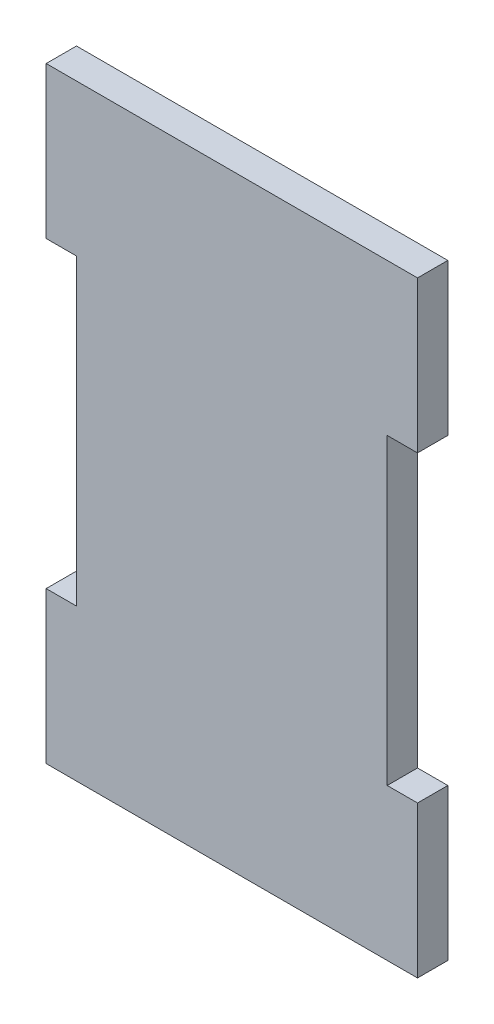
ISO-10303-21;
HEADER;
FILE_DESCRIPTION(('STEP AP214'),'2;1');
FILE_NAME('part.step','',(''),(''),'','','');
FILE_SCHEMA(('AUTOMOTIVE_DESIGN { 1 0 10303 214 1 1 1 1 }'));
ENDSEC;
DATA;
#1=APPLICATION_CONTEXT('core data for automotive mechanical design processes');
#2=APPLICATION_PROTOCOL_DEFINITION('international standard','automotive_design',2000,#1);
#3=PRODUCT_CONTEXT('',#1,'mechanical');
#4=PRODUCT('Part','Part','',(#3));
#5=PRODUCT_RELATED_PRODUCT_CATEGORY('part','',(#4));
#6=PRODUCT_DEFINITION_FORMATION('','',#4);
#7=PRODUCT_DEFINITION_CONTEXT('part definition',#1,'design');
#8=PRODUCT_DEFINITION('design','',#6,#7);
#9=PRODUCT_DEFINITION_SHAPE('','',#8);
#10=(LENGTH_UNIT() NAMED_UNIT(*) SI_UNIT(.MILLI.,.METRE.));
#11=(NAMED_UNIT(*) PLANE_ANGLE_UNIT() SI_UNIT($,.RADIAN.));
#12=(NAMED_UNIT(*) SI_UNIT($,.STERADIAN.) SOLID_ANGLE_UNIT());
#13=UNCERTAINTY_MEASURE_WITH_UNIT(LENGTH_MEASURE(1.E-05),#10,'distance_accuracy_value','');
#14=(GEOMETRIC_REPRESENTATION_CONTEXT(3) GLOBAL_UNCERTAINTY_ASSIGNED_CONTEXT((#13)) GLOBAL_UNIT_ASSIGNED_CONTEXT((#10,
#11,#12)) REPRESENTATION_CONTEXT('',''));
#15=CARTESIAN_POINT('',(0.,0.,0.));
#16=DIRECTION('',(0.,0.,1.));
#17=DIRECTION('',(1.,0.,0.));
#18=AXIS2_PLACEMENT_3D('',#15,#16,#17);
#19=CARTESIAN_POINT('',(-26.035,0.,5.08));
#20=DIRECTION('',(-1.,0.,0.));
#21=DIRECTION('',(0.,-1.,0.));
#22=AXIS2_PLACEMENT_3D('',#19,#20,#21);
#23=PLANE('',#22);
#24=DIRECTION('',(0.,1.,0.));
#25=VECTOR('',#24,1.);
#26=CARTESIAN_POINT('',(-26.035,0.,0.));
#27=LINE('',#26,#25);
#28=CARTESIAN_POINT('',(-26.035,-25.4,0.));
#29=VERTEX_POINT('',#28);
#30=CARTESIAN_POINT('',(-26.035,25.4,0.));
#31=VERTEX_POINT('',#30);
#32=EDGE_CURVE('E152',#29,#31,#27,.T.);
#33=ORIENTED_EDGE('',*,*,#32,.F.);
#34=DIRECTION('',(0.,0.,-1.));
#35=VECTOR('',#34,1.);
#36=CARTESIAN_POINT('',(-26.035,-25.4,5.08));
#37=LINE('',#36,#35);
#38=CARTESIAN_POINT('',(-26.035,-25.4,5.08));
#39=VERTEX_POINT('',#38);
#40=EDGE_CURVE('E11',#39,#29,#37,.T.);
#41=ORIENTED_EDGE('',*,*,#40,.F.);
#42=DIRECTION('',(0.,1.,0.));
#43=VECTOR('',#42,1.);
#44=CARTESIAN_POINT('',(-26.035,0.,5.08));
#45=LINE('',#44,#43);
#46=CARTESIAN_POINT('',(-26.035,25.4,5.08));
#47=VERTEX_POINT('',#46);
#48=EDGE_CURVE('E183',#39,#47,#45,.T.);
#49=ORIENTED_EDGE('',*,*,#48,.T.);
#50=DIRECTION('',(0.,0.,-1.));
#51=VECTOR('',#50,1.);
#52=CARTESIAN_POINT('',(-26.035,25.4,5.08));
#53=LINE('',#52,#51);
#54=EDGE_CURVE('E51',#47,#31,#53,.T.);
#55=ORIENTED_EDGE('',*,*,#54,.T.);
#56=EDGE_LOOP('',(#33,#41,#49,#55));
#57=FACE_BOUND('',#56,.T.);
#58=ADVANCED_FACE('F35',(#57),#23,.T.);
#59=CARTESIAN_POINT('',(0.,-25.4,5.08));
#60=DIRECTION('',(0.,-1.,0.));
#61=DIRECTION('',(0.,0.,-1.));
#62=AXIS2_PLACEMENT_3D('',#59,#60,#61);
#63=PLANE('',#62);
#64=DIRECTION('',(-1.,0.,0.));
#65=VECTOR('',#64,1.);
#66=CARTESIAN_POINT('',(0.,-25.4,0.));
#67=LINE('',#66,#65);
#68=CARTESIAN_POINT('',(-31.115,-25.4,0.));
#69=VERTEX_POINT('',#68);
#70=EDGE_CURVE('E154',#29,#69,#67,.T.);
#71=ORIENTED_EDGE('',*,*,#70,.T.);
#72=DIRECTION('',(0.,0.,-1.));
#73=VECTOR('',#72,1.);
#74=CARTESIAN_POINT('',(-31.115,-25.4,5.08));
#75=LINE('',#74,#73);
#76=CARTESIAN_POINT('',(-31.115,-25.4,5.08));
#77=VERTEX_POINT('',#76);
#78=EDGE_CURVE('E43',#77,#69,#75,.T.);
#79=ORIENTED_EDGE('',*,*,#78,.F.);
#80=DIRECTION('',(-1.,0.,0.));
#81=VECTOR('',#80,1.);
#82=CARTESIAN_POINT('',(0.,-25.4,5.08));
#83=LINE('',#82,#81);
#84=EDGE_CURVE('E219',#39,#77,#83,.T.);
#85=ORIENTED_EDGE('',*,*,#84,.F.);
#86=ORIENTED_EDGE('',*,*,#40,.T.);
#87=EDGE_LOOP('',(#71,#79,#85,#86));
#88=FACE_BOUND('',#87,.T.);
#89=ADVANCED_FACE('F208',(#88),#63,.F.);
#90=CARTESIAN_POINT('',(-31.115,0.,5.08));
#91=DIRECTION('',(-1.,0.,0.));
#92=DIRECTION('',(0.,0.,1.));
#93=AXIS2_PLACEMENT_3D('',#90,#91,#92);
#94=PLANE('',#93);
#95=DIRECTION('',(0.,1.,0.));
#96=VECTOR('',#95,1.);
#97=CARTESIAN_POINT('',(-31.115,0.,0.));
#98=LINE('',#97,#96);
#99=CARTESIAN_POINT('',(-31.115,-50.8,0.));
#100=VERTEX_POINT('',#99);
#101=EDGE_CURVE('E157',#100,#69,#98,.T.);
#102=ORIENTED_EDGE('',*,*,#101,.F.);
#103=DIRECTION('',(0.,0.,-1.));
#104=VECTOR('',#103,1.);
#105=CARTESIAN_POINT('',(-31.115,-50.8,5.08));
#106=LINE('',#105,#104);
#107=CARTESIAN_POINT('',(-31.115,-50.8,5.08));
#108=VERTEX_POINT('',#107);
#109=EDGE_CURVE('E198',#108,#100,#106,.T.);
#110=ORIENTED_EDGE('',*,*,#109,.F.);
#111=DIRECTION('',(0.,1.,0.));
#112=VECTOR('',#111,1.);
#113=CARTESIAN_POINT('',(-31.115,0.,5.08));
#114=LINE('',#113,#112);
#115=EDGE_CURVE('E205',#108,#77,#114,.T.);
#116=ORIENTED_EDGE('',*,*,#115,.T.);
#117=ORIENTED_EDGE('',*,*,#78,.T.);
#118=EDGE_LOOP('',(#102,#110,#116,#117));
#119=FACE_BOUND('',#118,.T.);
#120=ADVANCED_FACE('F203',(#119),#94,.T.);
#121=CARTESIAN_POINT('',(0.,-50.8,5.08));
#122=DIRECTION('',(0.,-1.,0.));
#123=DIRECTION('',(1.,0.,0.));
#124=AXIS2_PLACEMENT_3D('',#121,#122,#123);
#125=PLANE('',#124);
#126=DIRECTION('',(-1.,0.,0.));
#127=VECTOR('',#126,1.);
#128=CARTESIAN_POINT('',(0.,-50.8,0.));
#129=LINE('',#128,#127);
#130=CARTESIAN_POINT('',(31.115,-50.8,0.));
#131=VERTEX_POINT('',#130);
#132=EDGE_CURVE('E160',#131,#100,#129,.T.);
#133=ORIENTED_EDGE('',*,*,#132,.F.);
#134=DIRECTION('',(0.,0.,-1.));
#135=VECTOR('',#134,1.);
#136=CARTESIAN_POINT('',(31.115,-50.8,5.08));
#137=LINE('',#136,#135);
#138=CARTESIAN_POINT('',(31.115,-50.8,5.08));
#139=VERTEX_POINT('',#138);
#140=EDGE_CURVE('E196',#139,#131,#137,.T.);
#141=ORIENTED_EDGE('',*,*,#140,.F.);
#142=DIRECTION('',(-1.,0.,0.));
#143=VECTOR('',#142,1.);
#144=CARTESIAN_POINT('',(0.,-50.8,5.08));
#145=LINE('',#144,#143);
#146=EDGE_CURVE('E218',#139,#108,#145,.T.);
#147=ORIENTED_EDGE('',*,*,#146,.T.);
#148=ORIENTED_EDGE('',*,*,#109,.T.);
#149=EDGE_LOOP('',(#133,#141,#147,#148));
#150=FACE_BOUND('',#149,.T.);
#151=ADVANCED_FACE('F214',(#150),#125,.T.);
#152=CARTESIAN_POINT('',(31.115,0.,5.08));
#153=DIRECTION('',(-1.,0.,0.));
#154=DIRECTION('',(0.,0.,1.));
#155=AXIS2_PLACEMENT_3D('',#152,#153,#154);
#156=PLANE('',#155);
#157=DIRECTION('',(0.,1.,0.));
#158=VECTOR('',#157,1.);
#159=CARTESIAN_POINT('',(31.115,0.,0.));
#160=LINE('',#159,#158);
#161=CARTESIAN_POINT('',(31.115,-25.4,0.));
#162=VERTEX_POINT('',#161);
#163=EDGE_CURVE('E163',#131,#162,#160,.T.);
#164=ORIENTED_EDGE('',*,*,#163,.T.);
#165=DIRECTION('',(0.,0.,-1.));
#166=VECTOR('',#165,1.);
#167=CARTESIAN_POINT('',(31.115,-25.4,5.08));
#168=LINE('',#167,#166);
#169=CARTESIAN_POINT('',(31.115,-25.4,5.08));
#170=VERTEX_POINT('',#169);
#171=EDGE_CURVE('E194',#170,#162,#168,.T.);
#172=ORIENTED_EDGE('',*,*,#171,.F.);
#173=DIRECTION('',(0.,1.,0.));
#174=VECTOR('',#173,1.);
#175=CARTESIAN_POINT('',(31.115,0.,5.08));
#176=LINE('',#175,#174);
#177=EDGE_CURVE('E221',#139,#170,#176,.T.);
#178=ORIENTED_EDGE('',*,*,#177,.F.);
#179=ORIENTED_EDGE('',*,*,#140,.T.);
#180=EDGE_LOOP('',(#164,#172,#178,#179));
#181=FACE_BOUND('',#180,.T.);
#182=ADVANCED_FACE('F259',(#181),#156,.F.);
#183=CARTESIAN_POINT('',(0.,-25.4,5.08));
#184=DIRECTION('',(0.,1.,0.));
#185=DIRECTION('',(0.,0.,1.));
#186=AXIS2_PLACEMENT_3D('',#183,#184,#185);
#187=PLANE('',#186);
#188=DIRECTION('',(1.,0.,0.));
#189=VECTOR('',#188,1.);
#190=CARTESIAN_POINT('',(0.,-25.4,0.));
#191=LINE('',#190,#189);
#192=CARTESIAN_POINT('',(26.035,-25.4,0.));
#193=VERTEX_POINT('',#192);
#194=EDGE_CURVE('E166',#193,#162,#191,.T.);
#195=ORIENTED_EDGE('',*,*,#194,.F.);
#196=DIRECTION('',(0.,0.,-1.));
#197=VECTOR('',#196,1.);
#198=CARTESIAN_POINT('',(26.035,-25.4,5.08));
#199=LINE('',#198,#197);
#200=CARTESIAN_POINT('',(26.035,-25.4,5.08));
#201=VERTEX_POINT('',#200);
#202=EDGE_CURVE('E192',#201,#193,#199,.T.);
#203=ORIENTED_EDGE('',*,*,#202,.F.);
#204=DIRECTION('',(1.,0.,0.));
#205=VECTOR('',#204,1.);
#206=CARTESIAN_POINT('',(0.,-25.4,5.08));
#207=LINE('',#206,#205);
#208=EDGE_CURVE('E227',#201,#170,#207,.T.);
#209=ORIENTED_EDGE('',*,*,#208,.T.);
#210=ORIENTED_EDGE('',*,*,#171,.T.);
#211=EDGE_LOOP('',(#195,#203,#209,#210));
#212=FACE_BOUND('',#211,.T.);
#213=ADVANCED_FACE('F262',(#212),#187,.T.);
#214=CARTESIAN_POINT('',(26.035,0.,5.08));
#215=DIRECTION('',(-1.,0.,0.));
#216=DIRECTION('',(0.,-1.,0.));
#217=AXIS2_PLACEMENT_3D('',#214,#215,#216);
#218=PLANE('',#217);
#219=DIRECTION('',(0.,1.,0.));
#220=VECTOR('',#219,1.);
#221=CARTESIAN_POINT('',(26.035,0.,0.));
#222=LINE('',#221,#220);
#223=CARTESIAN_POINT('',(26.035,25.4,0.));
#224=VERTEX_POINT('',#223);
#225=EDGE_CURVE('E169',#193,#224,#222,.T.);
#226=ORIENTED_EDGE('',*,*,#225,.T.);
#227=DIRECTION('',(0.,0.,-1.));
#228=VECTOR('',#227,1.);
#229=CARTESIAN_POINT('',(26.035,25.4,5.08));
#230=LINE('',#229,#228);
#231=CARTESIAN_POINT('',(26.035,25.4,5.08));
#232=VERTEX_POINT('',#231);
#233=EDGE_CURVE('E189',#232,#224,#230,.T.);
#234=ORIENTED_EDGE('',*,*,#233,.F.);
#235=DIRECTION('',(0.,1.,0.));
#236=VECTOR('',#235,1.);
#237=CARTESIAN_POINT('',(26.035,0.,5.08));
#238=LINE('',#237,#236);
#239=EDGE_CURVE('E230',#201,#232,#238,.T.);
#240=ORIENTED_EDGE('',*,*,#239,.F.);
#241=ORIENTED_EDGE('',*,*,#202,.T.);
#242=EDGE_LOOP('',(#226,#234,#240,#241));
#243=FACE_BOUND('',#242,.T.);
#244=ADVANCED_FACE('F266',(#243),#218,.F.);
#245=CARTESIAN_POINT('',(0.,25.4,5.08));
#246=DIRECTION('',(0.,1.,0.));
#247=DIRECTION('',(-1.,0.,0.));
#248=AXIS2_PLACEMENT_3D('',#245,#246,#247);
#249=PLANE('',#248);
#250=DIRECTION('',(1.,0.,0.));
#251=VECTOR('',#250,1.);
#252=CARTESIAN_POINT('',(0.,25.4,0.));
#253=LINE('',#252,#251);
#254=CARTESIAN_POINT('',(31.115,25.4,0.));
#255=VERTEX_POINT('',#254);
#256=EDGE_CURVE('E171',#224,#255,#253,.T.);
#257=ORIENTED_EDGE('',*,*,#256,.T.);
#258=DIRECTION('',(0.,0.,-1.));
#259=VECTOR('',#258,1.);
#260=CARTESIAN_POINT('',(31.115,25.4,5.08));
#261=LINE('',#260,#259);
#262=CARTESIAN_POINT('',(31.115,25.4,5.08));
#263=VERTEX_POINT('',#262);
#264=EDGE_CURVE('E187',#263,#255,#261,.T.);
#265=ORIENTED_EDGE('',*,*,#264,.F.);
#266=DIRECTION('',(1.,0.,0.));
#267=VECTOR('',#266,1.);
#268=CARTESIAN_POINT('',(0.,25.4,5.08));
#269=LINE('',#268,#267);
#270=EDGE_CURVE('E232',#232,#263,#269,.T.);
#271=ORIENTED_EDGE('',*,*,#270,.F.);
#272=ORIENTED_EDGE('',*,*,#233,.T.);
#273=EDGE_LOOP('',(#257,#265,#271,#272));
#274=FACE_BOUND('',#273,.T.);
#275=ADVANCED_FACE('F270',(#274),#249,.F.);
#276=CARTESIAN_POINT('',(31.115,0.,5.08));
#277=DIRECTION('',(1.,0.,0.));
#278=DIRECTION('',(0.,1.,0.));
#279=AXIS2_PLACEMENT_3D('',#276,#277,#278);
#280=PLANE('',#279);
#281=DIRECTION('',(0.,-1.,0.));
#282=VECTOR('',#281,1.);
#283=CARTESIAN_POINT('',(31.115,0.,0.));
#284=LINE('',#283,#282);
#285=CARTESIAN_POINT('',(31.115,50.8,0.));
#286=VERTEX_POINT('',#285);
#287=EDGE_CURVE('E174',#286,#255,#284,.T.);
#288=ORIENTED_EDGE('',*,*,#287,.F.);
#289=DIRECTION('',(0.,0.,-1.));
#290=VECTOR('',#289,1.);
#291=CARTESIAN_POINT('',(31.115,50.8,5.08));
#292=LINE('',#291,#290);
#293=CARTESIAN_POINT('',(31.115,50.8,5.08));
#294=VERTEX_POINT('',#293);
#295=EDGE_CURVE('E144',#294,#286,#292,.T.);
#296=ORIENTED_EDGE('',*,*,#295,.F.);
#297=DIRECTION('',(0.,-1.,0.));
#298=VECTOR('',#297,1.);
#299=CARTESIAN_POINT('',(31.115,0.,5.08));
#300=LINE('',#299,#298);
#301=EDGE_CURVE('E134',#294,#263,#300,.T.);
#302=ORIENTED_EDGE('',*,*,#301,.T.);
#303=ORIENTED_EDGE('',*,*,#264,.T.);
#304=EDGE_LOOP('',(#288,#296,#302,#303));
#305=FACE_BOUND('',#304,.T.);
#306=ADVANCED_FACE('F235',(#305),#280,.T.);
#307=CARTESIAN_POINT('',(0.,50.8,5.08));
#308=DIRECTION('',(0.,-1.,0.));
#309=DIRECTION('',(1.,0.,0.));
#310=AXIS2_PLACEMENT_3D('',#307,#308,#309);
#311=PLANE('',#310);
#312=DIRECTION('',(-1.,0.,0.));
#313=VECTOR('',#312,1.);
#314=CARTESIAN_POINT('',(0.,50.8,0.));
#315=LINE('',#314,#313);
#316=CARTESIAN_POINT('',(-31.115,50.8,0.));
#317=VERTEX_POINT('',#316);
#318=EDGE_CURVE('E141',#286,#317,#315,.T.);
#319=ORIENTED_EDGE('',*,*,#318,.T.);
#320=DIRECTION('',(0.,0.,-1.));
#321=VECTOR('',#320,1.);
#322=CARTESIAN_POINT('',(-31.115,50.8,5.08));
#323=LINE('',#322,#321);
#324=CARTESIAN_POINT('',(-31.115,50.8,5.08));
#325=VERTEX_POINT('',#324);
#326=EDGE_CURVE('E138',#325,#317,#323,.T.);
#327=ORIENTED_EDGE('',*,*,#326,.F.);
#328=DIRECTION('',(-1.,0.,0.));
#329=VECTOR('',#328,1.);
#330=CARTESIAN_POINT('',(0.,50.8,5.08));
#331=LINE('',#330,#329);
#332=EDGE_CURVE('E126',#294,#325,#331,.T.);
#333=ORIENTED_EDGE('',*,*,#332,.F.);
#334=ORIENTED_EDGE('',*,*,#295,.T.);
#335=EDGE_LOOP('',(#319,#327,#333,#334));
#336=FACE_BOUND('',#335,.T.);
#337=ADVANCED_FACE('F139',(#336),#311,.F.);
#338=CARTESIAN_POINT('',(-31.115,0.,5.08));
#339=DIRECTION('',(1.,0.,0.));
#340=DIRECTION('',(0.,1.,0.));
#341=AXIS2_PLACEMENT_3D('',#338,#339,#340);
#342=PLANE('',#341);
#343=DIRECTION('',(0.,-1.,0.));
#344=VECTOR('',#343,1.);
#345=CARTESIAN_POINT('',(-31.115,0.,0.));
#346=LINE('',#345,#344);
#347=CARTESIAN_POINT('',(-31.115,25.4,0.));
#348=VERTEX_POINT('',#347);
#349=EDGE_CURVE('E178',#317,#348,#346,.T.);
#350=ORIENTED_EDGE('',*,*,#349,.T.);
#351=DIRECTION('',(0.,0.,-1.));
#352=VECTOR('',#351,1.);
#353=CARTESIAN_POINT('',(-31.115,25.4,5.08));
#354=LINE('',#353,#352);
#355=CARTESIAN_POINT('',(-31.115,25.4,5.08));
#356=VERTEX_POINT('',#355);
#357=EDGE_CURVE('E89',#356,#348,#354,.T.);
#358=ORIENTED_EDGE('',*,*,#357,.F.);
#359=DIRECTION('',(0.,-1.,0.));
#360=VECTOR('',#359,1.);
#361=CARTESIAN_POINT('',(-31.115,0.,5.08));
#362=LINE('',#361,#360);
#363=EDGE_CURVE('E132',#325,#356,#362,.T.);
#364=ORIENTED_EDGE('',*,*,#363,.F.);
#365=ORIENTED_EDGE('',*,*,#326,.T.);
#366=EDGE_LOOP('',(#350,#358,#364,#365));
#367=FACE_BOUND('',#366,.T.);
#368=ADVANCED_FACE('F146',(#367),#342,.F.);
#369=CARTESIAN_POINT('',(0.,25.4,5.08));
#370=DIRECTION('',(0.,-1.,0.));
#371=DIRECTION('',(0.,0.,-1.));
#372=AXIS2_PLACEMENT_3D('',#369,#370,#371);
#373=PLANE('',#372);
#374=DIRECTION('',(-1.,0.,0.));
#375=VECTOR('',#374,1.);
#376=CARTESIAN_POINT('',(0.,25.4,0.));
#377=LINE('',#376,#375);
#378=EDGE_CURVE('E180',#31,#348,#377,.T.);
#379=ORIENTED_EDGE('',*,*,#378,.F.);
#380=ORIENTED_EDGE('',*,*,#54,.F.);
#381=DIRECTION('',(-1.,0.,0.));
#382=VECTOR('',#381,1.);
#383=CARTESIAN_POINT('',(0.,25.4,5.08));
#384=LINE('',#383,#382);
#385=EDGE_CURVE('E147',#47,#356,#384,.T.);
#386=ORIENTED_EDGE('',*,*,#385,.T.);
#387=ORIENTED_EDGE('',*,*,#357,.T.);
#388=EDGE_LOOP('',(#379,#380,#386,#387));
#389=FACE_BOUND('',#388,.T.);
#390=ADVANCED_FACE('F238',(#389),#373,.T.);
#391=CARTESIAN_POINT('',(0.,0.,5.08));
#392=DIRECTION('',(0.,0.,1.));
#393=DIRECTION('',(1.,0.,0.));
#394=AXIS2_PLACEMENT_3D('',#391,#392,#393);
#395=PLANE('',#394);
#396=ORIENTED_EDGE('',*,*,#48,.F.);
#397=ORIENTED_EDGE('',*,*,#84,.T.);
#398=ORIENTED_EDGE('',*,*,#115,.F.);
#399=ORIENTED_EDGE('',*,*,#146,.F.);
#400=ORIENTED_EDGE('',*,*,#177,.T.);
#401=ORIENTED_EDGE('',*,*,#208,.F.);
#402=ORIENTED_EDGE('',*,*,#239,.T.);
#403=ORIENTED_EDGE('',*,*,#270,.T.);
#404=ORIENTED_EDGE('',*,*,#301,.F.);
#405=ORIENTED_EDGE('',*,*,#332,.T.);
#406=ORIENTED_EDGE('',*,*,#363,.T.);
#407=ORIENTED_EDGE('',*,*,#385,.F.);
#408=EDGE_LOOP('',(#396,#397,#398,#399,#400,#401,#402,#403,#404,#405,#406,#407));
#409=FACE_BOUND('',#408,.T.);
#410=ADVANCED_FACE('F129',(#409),#395,.T.);
#411=CARTESIAN_POINT('',(0.,0.,0.));
#412=DIRECTION('',(0.,0.,1.));
#413=DIRECTION('',(1.,0.,0.));
#414=AXIS2_PLACEMENT_3D('',#411,#412,#413);
#415=PLANE('',#414);
#416=ORIENTED_EDGE('',*,*,#32,.T.);
#417=ORIENTED_EDGE('',*,*,#378,.T.);
#418=ORIENTED_EDGE('',*,*,#349,.F.);
#419=ORIENTED_EDGE('',*,*,#318,.F.);
#420=ORIENTED_EDGE('',*,*,#287,.T.);
#421=ORIENTED_EDGE('',*,*,#256,.F.);
#422=ORIENTED_EDGE('',*,*,#225,.F.);
#423=ORIENTED_EDGE('',*,*,#194,.T.);
#424=ORIENTED_EDGE('',*,*,#163,.F.);
#425=ORIENTED_EDGE('',*,*,#132,.T.);
#426=ORIENTED_EDGE('',*,*,#101,.T.);
#427=ORIENTED_EDGE('',*,*,#70,.F.);
#428=EDGE_LOOP('',(#416,#417,#418,#419,#420,#421,#422,#423,#424,#425,#426,#427));
#429=FACE_BOUND('',#428,.T.);
#430=ADVANCED_FACE('F210',(#429),#415,.F.);
#431=CLOSED_SHELL('',(#58,#89,#120,#151,#182,#213,#244,#275,#306,#337,#368,#390,#410,#430));
#432=MANIFOLD_SOLID_BREP('B2',#431);
#433=ADVANCED_BREP_SHAPE_REPRESENTATION('',(#18,#432),#14);
#434=SHAPE_DEFINITION_REPRESENTATION(#9,#433);
ENDSEC;
END-ISO-10303-21;
